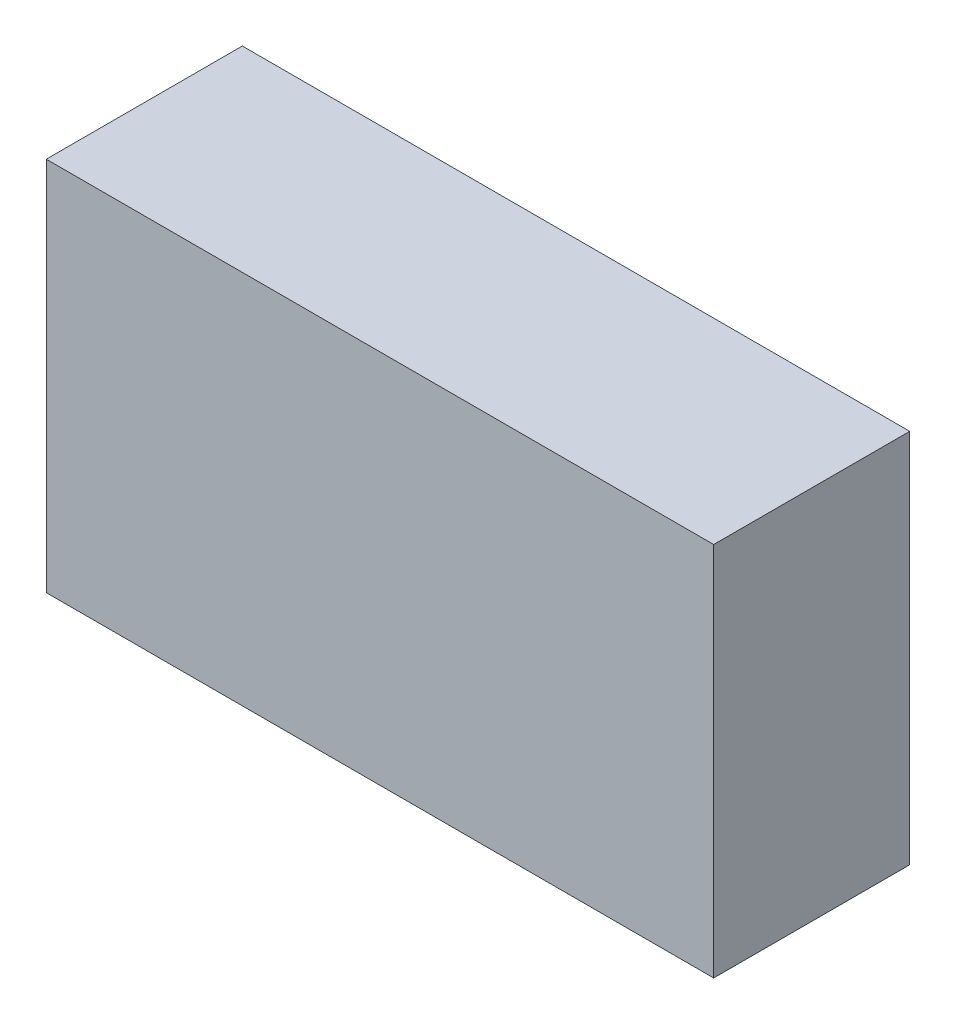
ISO-10303-21;
HEADER;
FILE_DESCRIPTION(('STEP AP214'),'2;1');
FILE_NAME('part.step','',(''),(''),'','','');
FILE_SCHEMA(('AUTOMOTIVE_DESIGN { 1 0 10303 214 1 1 1 1 }'));
ENDSEC;
DATA;
#1=APPLICATION_CONTEXT('core data for automotive mechanical design processes');
#2=APPLICATION_PROTOCOL_DEFINITION('international standard','automotive_design',2000,#1);
#3=PRODUCT_CONTEXT('',#1,'mechanical');
#4=PRODUCT('Part','Part','',(#3));
#5=PRODUCT_RELATED_PRODUCT_CATEGORY('part','',(#4));
#6=PRODUCT_DEFINITION_FORMATION('','',#4);
#7=PRODUCT_DEFINITION_CONTEXT('part definition',#1,'design');
#8=PRODUCT_DEFINITION('design','',#6,#7);
#9=PRODUCT_DEFINITION_SHAPE('','',#8);
#10=(LENGTH_UNIT() NAMED_UNIT(*) SI_UNIT(.MILLI.,.METRE.));
#11=(NAMED_UNIT(*) PLANE_ANGLE_UNIT() SI_UNIT($,.RADIAN.));
#12=(NAMED_UNIT(*) SI_UNIT($,.STERADIAN.) SOLID_ANGLE_UNIT());
#13=UNCERTAINTY_MEASURE_WITH_UNIT(LENGTH_MEASURE(1.E-05),#10,'distance_accuracy_value','');
#14=(GEOMETRIC_REPRESENTATION_CONTEXT(3) GLOBAL_UNCERTAINTY_ASSIGNED_CONTEXT((#13)) GLOBAL_UNIT_ASSIGNED_CONTEXT((#10,
#11,#12)) REPRESENTATION_CONTEXT('',''));
#15=CARTESIAN_POINT('',(0.,0.,0.));
#16=DIRECTION('',(0.,0.,1.));
#17=DIRECTION('',(1.,0.,0.));
#18=AXIS2_PLACEMENT_3D('',#15,#16,#17);
#19=CARTESIAN_POINT('',(0.,0.,2.35));
#20=DIRECTION('',(1.,0.,0.));
#21=DIRECTION('',(0.,0.,-1.));
#22=AXIS2_PLACEMENT_3D('',#19,#20,#21);
#23=PLANE('',#22);
#24=DIRECTION('',(0.,-1.,0.));
#25=VECTOR('',#24,1.);
#26=CARTESIAN_POINT('',(0.,0.,0.));
#27=LINE('',#26,#25);
#28=CARTESIAN_POINT('',(0.,4.49999999999996,0.));
#29=VERTEX_POINT('',#28);
#30=CARTESIAN_POINT('',(0.,0.,0.));
#31=VERTEX_POINT('',#30);
#32=EDGE_CURVE('E107',#29,#31,#27,.T.);
#33=ORIENTED_EDGE('',*,*,#32,.T.);
#34=DIRECTION('',(0.,0.,-1.));
#35=VECTOR('',#34,1.);
#36=CARTESIAN_POINT('',(0.,0.,2.35));
#37=LINE('',#36,#35);
#38=CARTESIAN_POINT('',(0.,0.,2.35));
#39=VERTEX_POINT('',#38);
#40=EDGE_CURVE('E11',#39,#31,#37,.T.);
#41=ORIENTED_EDGE('',*,*,#40,.F.);
#42=DIRECTION('',(0.,-1.,0.));
#43=VECTOR('',#42,1.);
#44=CARTESIAN_POINT('',(0.,0.,2.35));
#45=LINE('',#44,#43);
#46=CARTESIAN_POINT('',(0.,4.49999999999996,2.35));
#47=VERTEX_POINT('',#46);
#48=EDGE_CURVE('E91',#47,#39,#45,.T.);
#49=ORIENTED_EDGE('',*,*,#48,.F.);
#50=DIRECTION('',(0.,0.,-1.));
#51=VECTOR('',#50,1.);
#52=CARTESIAN_POINT('',(0.,4.49999999999996,2.35));
#53=LINE('',#52,#51);
#54=EDGE_CURVE('E103',#47,#29,#53,.T.);
#55=ORIENTED_EDGE('',*,*,#54,.T.);
#56=EDGE_LOOP('',(#33,#41,#49,#55));
#57=FACE_BOUND('',#56,.T.);
#58=ADVANCED_FACE('F39',(#57),#23,.F.);
#59=CARTESIAN_POINT('',(0.,0.,2.35));
#60=DIRECTION('',(0.,1.,0.));
#61=DIRECTION('',(0.,0.,1.));
#62=AXIS2_PLACEMENT_3D('',#59,#60,#61);
#63=PLANE('',#62);
#64=DIRECTION('',(1.,0.,0.));
#65=VECTOR('',#64,1.);
#66=CARTESIAN_POINT('',(0.,0.,0.));
#67=LINE('',#66,#65);
#68=CARTESIAN_POINT('',(8.,0.,0.));
#69=VERTEX_POINT('',#68);
#70=EDGE_CURVE('E96',#31,#69,#67,.T.);
#71=ORIENTED_EDGE('',*,*,#70,.T.);
#72=DIRECTION('',(0.,0.,-1.));
#73=VECTOR('',#72,1.);
#74=CARTESIAN_POINT('',(8.,0.,2.35));
#75=LINE('',#74,#73);
#76=CARTESIAN_POINT('',(8.,0.,2.35));
#77=VERTEX_POINT('',#76);
#78=EDGE_CURVE('E48',#77,#69,#75,.T.);
#79=ORIENTED_EDGE('',*,*,#78,.F.);
#80=DIRECTION('',(1.,0.,0.));
#81=VECTOR('',#80,1.);
#82=CARTESIAN_POINT('',(0.,0.,2.35));
#83=LINE('',#82,#81);
#84=EDGE_CURVE('E86',#39,#77,#83,.T.);
#85=ORIENTED_EDGE('',*,*,#84,.F.);
#86=ORIENTED_EDGE('',*,*,#40,.T.);
#87=EDGE_LOOP('',(#71,#79,#85,#86));
#88=FACE_BOUND('',#87,.T.);
#89=ADVANCED_FACE('F95',(#88),#63,.F.);
#90=CARTESIAN_POINT('',(8.,0.,2.35));
#91=DIRECTION('',(-1.,0.,0.));
#92=DIRECTION('',(0.,0.,1.));
#93=AXIS2_PLACEMENT_3D('',#90,#91,#92);
#94=PLANE('',#93);
#95=DIRECTION('',(0.,1.,0.));
#96=VECTOR('',#95,1.);
#97=CARTESIAN_POINT('',(8.,0.,0.));
#98=LINE('',#97,#96);
#99=CARTESIAN_POINT('',(8.,4.5,0.));
#100=VERTEX_POINT('',#99);
#101=EDGE_CURVE('E73',#69,#100,#98,.T.);
#102=ORIENTED_EDGE('',*,*,#101,.T.);
#103=DIRECTION('',(0.,0.,-1.));
#104=VECTOR('',#103,1.);
#105=CARTESIAN_POINT('',(8.00000000000009,4.5,2.35));
#106=LINE('',#105,#104);
#107=CARTESIAN_POINT('',(8.00000000000009,4.5,2.35));
#108=VERTEX_POINT('',#107);
#109=EDGE_CURVE('E98',#108,#100,#106,.T.);
#110=ORIENTED_EDGE('',*,*,#109,.F.);
#111=DIRECTION('',(0.,1.,0.));
#112=VECTOR('',#111,1.);
#113=CARTESIAN_POINT('',(8.,0.,2.35));
#114=LINE('',#113,#112);
#115=EDGE_CURVE('E89',#77,#108,#114,.T.);
#116=ORIENTED_EDGE('',*,*,#115,.F.);
#117=ORIENTED_EDGE('',*,*,#78,.T.);
#118=EDGE_LOOP('',(#102,#110,#116,#117));
#119=FACE_BOUND('',#118,.T.);
#120=ADVANCED_FACE('F99',(#119),#94,.F.);
#121=CARTESIAN_POINT('',(0.,4.49999999999996,2.35));
#122=DIRECTION('',(0.,-1.,0.));
#123=DIRECTION('',(0.,0.,-1.));
#124=AXIS2_PLACEMENT_3D('',#121,#122,#123);
#125=PLANE('',#124);
#126=DIRECTION('',(-1.,0.,0.));
#127=VECTOR('',#126,1.);
#128=CARTESIAN_POINT('',(0.,4.49999999999996,0.));
#129=LINE('',#128,#127);
#130=EDGE_CURVE('E79',#100,#29,#129,.T.);
#131=ORIENTED_EDGE('',*,*,#130,.T.);
#132=ORIENTED_EDGE('',*,*,#54,.F.);
#133=DIRECTION('',(-1.,0.,0.));
#134=VECTOR('',#133,1.);
#135=CARTESIAN_POINT('',(0.,4.49999999999996,2.35));
#136=LINE('',#135,#134);
#137=EDGE_CURVE('E56',#108,#47,#136,.T.);
#138=ORIENTED_EDGE('',*,*,#137,.F.);
#139=ORIENTED_EDGE('',*,*,#109,.T.);
#140=EDGE_LOOP('',(#131,#132,#138,#139));
#141=FACE_BOUND('',#140,.T.);
#142=ADVANCED_FACE('F120',(#141),#125,.F.);
#143=CARTESIAN_POINT('',(0.,0.,2.35));
#144=DIRECTION('',(0.,0.,-1.));
#145=DIRECTION('',(-1.,0.,0.));
#146=AXIS2_PLACEMENT_3D('',#143,#144,#145);
#147=PLANE('',#146);
#148=ORIENTED_EDGE('',*,*,#48,.T.);
#149=ORIENTED_EDGE('',*,*,#84,.T.);
#150=ORIENTED_EDGE('',*,*,#115,.T.);
#151=ORIENTED_EDGE('',*,*,#137,.T.);
#152=EDGE_LOOP('',(#148,#149,#150,#151));
#153=FACE_BOUND('',#152,.T.);
#154=ADVANCED_FACE('F87',(#153),#147,.F.);
#155=CARTESIAN_POINT('',(0.,0.,0.));
#156=DIRECTION('',(0.,0.,-1.));
#157=DIRECTION('',(-1.,0.,0.));
#158=AXIS2_PLACEMENT_3D('',#155,#156,#157);
#159=PLANE('',#158);
#160=ORIENTED_EDGE('',*,*,#32,.F.);
#161=ORIENTED_EDGE('',*,*,#130,.F.);
#162=ORIENTED_EDGE('',*,*,#101,.F.);
#163=ORIENTED_EDGE('',*,*,#70,.F.);
#164=EDGE_LOOP('',(#160,#161,#162,#163));
#165=FACE_BOUND('',#164,.T.);
#166=ADVANCED_FACE('F123',(#165),#159,.T.);
#167=CLOSED_SHELL('',(#58,#89,#120,#142,#154,#166));
#168=MANIFOLD_SOLID_BREP('B2',#167);
#169=ADVANCED_BREP_SHAPE_REPRESENTATION('',(#18,#168),#14);
#170=SHAPE_DEFINITION_REPRESENTATION(#9,#169);
ENDSEC;
END-ISO-10303-21;
